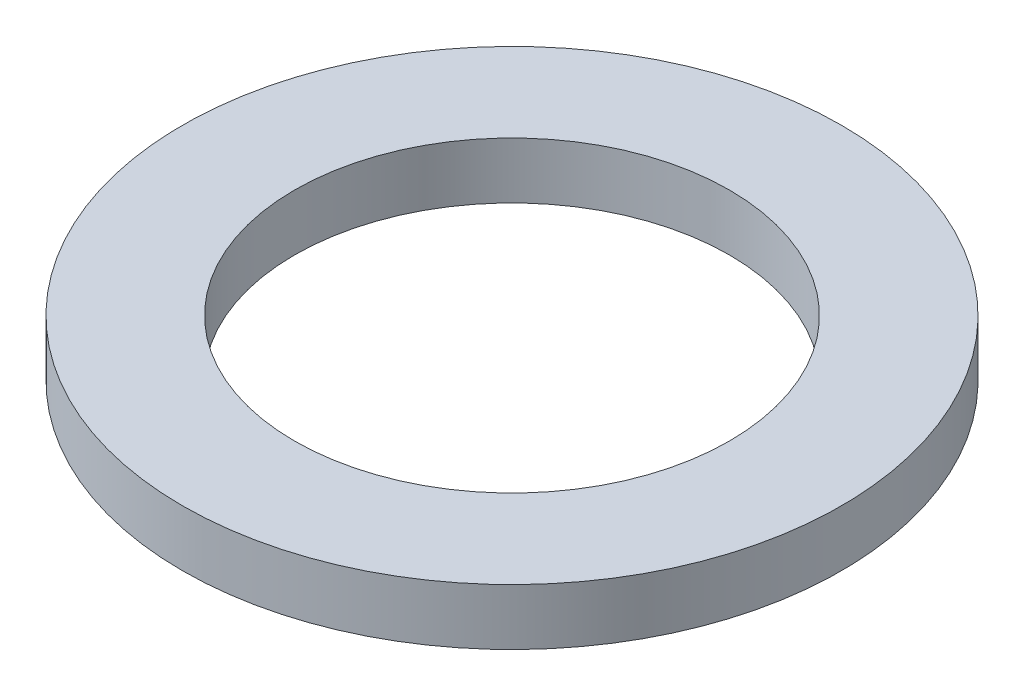
ISO-10303-21;
HEADER;
FILE_DESCRIPTION(('STEP AP214'),'2;1');
FILE_NAME('part.step','',(''),(''),'','','');
FILE_SCHEMA(('AUTOMOTIVE_DESIGN { 1 0 10303 214 1 1 1 1 }'));
ENDSEC;
DATA;
#1=APPLICATION_CONTEXT('core data for automotive mechanical design processes');
#2=APPLICATION_PROTOCOL_DEFINITION('international standard','automotive_design',2000,#1);
#3=PRODUCT_CONTEXT('',#1,'mechanical');
#4=PRODUCT('Part','Part','',(#3));
#5=PRODUCT_RELATED_PRODUCT_CATEGORY('part','',(#4));
#6=PRODUCT_DEFINITION_FORMATION('','',#4);
#7=PRODUCT_DEFINITION_CONTEXT('part definition',#1,'design');
#8=PRODUCT_DEFINITION('design','',#6,#7);
#9=PRODUCT_DEFINITION_SHAPE('','',#8);
#10=(LENGTH_UNIT() NAMED_UNIT(*) SI_UNIT(.MILLI.,.METRE.));
#11=(NAMED_UNIT(*) PLANE_ANGLE_UNIT() SI_UNIT($,.RADIAN.));
#12=(NAMED_UNIT(*) SI_UNIT($,.STERADIAN.) SOLID_ANGLE_UNIT());
#13=UNCERTAINTY_MEASURE_WITH_UNIT(LENGTH_MEASURE(1.E-05),#10,'distance_accuracy_value','');
#14=(GEOMETRIC_REPRESENTATION_CONTEXT(3) GLOBAL_UNCERTAINTY_ASSIGNED_CONTEXT((#13)) GLOBAL_UNIT_ASSIGNED_CONTEXT((#10,
#11,#12)) REPRESENTATION_CONTEXT('',''));
#15=CARTESIAN_POINT('',(0.,0.,0.));
#16=DIRECTION('',(0.,0.,1.));
#17=DIRECTION('',(1.,0.,0.));
#18=AXIS2_PLACEMENT_3D('',#15,#16,#17);
#19=CARTESIAN_POINT('',(0.,0.8382,0.));
#20=DIRECTION('',(0.,1.,0.));
#21=DIRECTION('',(0.,0.,1.));
#22=AXIS2_PLACEMENT_3D('',#19,#20,#21);
#23=PLANE('',#22);
#24=CARTESIAN_POINT('',(0.,0.8382,0.));
#25=DIRECTION('',(0.,1.,0.));
#26=DIRECTION('',(0.,0.,1.));
#27=AXIS2_PLACEMENT_3D('',#24,#25,#26);
#28=CIRCLE('',#27,4.90855);
#29=CARTESIAN_POINT('',(0.,0.8382,4.90855));
#30=VERTEX_POINT('',#29);
#31=EDGE_CURVE('E10',#30,#30,#28,.T.);
#32=ORIENTED_EDGE('',*,*,#31,.T.);
#33=EDGE_LOOP('',(#32));
#34=FACE_BOUND('',#33,.T.);
#35=CARTESIAN_POINT('',(0.,0.8382,0.));
#36=DIRECTION('',(0.,1.,0.));
#37=DIRECTION('',(0.,0.,1.));
#38=AXIS2_PLACEMENT_3D('',#35,#36,#37);
#39=CIRCLE('',#38,3.2385);
#40=CARTESIAN_POINT('',(0.,0.8382,3.2385));
#41=VERTEX_POINT('',#40);
#42=EDGE_CURVE('E41',#41,#41,#39,.T.);
#43=ORIENTED_EDGE('',*,*,#42,.F.);
#44=EDGE_LOOP('',(#43));
#45=FACE_BOUND('',#44,.T.);
#46=ADVANCED_FACE('F30',(#34,#45),#23,.T.);
#47=CARTESIAN_POINT('',(0.,0.,0.));
#48=DIRECTION('',(0.,1.,0.));
#49=DIRECTION('',(0.,0.,1.));
#50=AXIS2_PLACEMENT_3D('',#47,#48,#49);
#51=PLANE('',#50);
#52=CARTESIAN_POINT('',(0.,0.,0.));
#53=DIRECTION('',(0.,1.,0.));
#54=DIRECTION('',(0.,0.,1.));
#55=AXIS2_PLACEMENT_3D('',#52,#53,#54);
#56=CIRCLE('',#55,4.90855);
#57=CARTESIAN_POINT('',(0.,0.,4.90855));
#58=VERTEX_POINT('',#57);
#59=EDGE_CURVE('E34',#58,#58,#56,.T.);
#60=ORIENTED_EDGE('',*,*,#59,.F.);
#61=EDGE_LOOP('',(#60));
#62=FACE_BOUND('',#61,.T.);
#63=CARTESIAN_POINT('',(0.,0.,0.));
#64=DIRECTION('',(0.,1.,0.));
#65=DIRECTION('',(0.,0.,1.));
#66=AXIS2_PLACEMENT_3D('',#63,#64,#65);
#67=CIRCLE('',#66,3.2385);
#68=CARTESIAN_POINT('',(0.,0.,3.2385));
#69=VERTEX_POINT('',#68);
#70=EDGE_CURVE('E43',#69,#69,#67,.T.);
#71=ORIENTED_EDGE('',*,*,#70,.T.);
#72=EDGE_LOOP('',(#71));
#73=FACE_BOUND('',#72,.T.);
#74=ADVANCED_FACE('F53',(#62,#73),#51,.F.);
#75=CARTESIAN_POINT('',(0.,0.8382,0.));
#76=DIRECTION('',(0.,-1.,0.));
#77=DIRECTION('',(0.,0.,-1.));
#78=AXIS2_PLACEMENT_3D('',#75,#76,#77);
#79=CYLINDRICAL_SURFACE('',#78,4.90855);
#80=ORIENTED_EDGE('',*,*,#31,.F.);
#81=EDGE_LOOP('',(#80));
#82=FACE_BOUND('',#81,.T.);
#83=ORIENTED_EDGE('',*,*,#59,.T.);
#84=EDGE_LOOP('',(#83));
#85=FACE_BOUND('',#84,.T.);
#86=ADVANCED_FACE('F32',(#82,#85),#79,.T.);
#87=CARTESIAN_POINT('',(0.,0.8382,0.));
#88=DIRECTION('',(0.,-1.,0.));
#89=DIRECTION('',(0.,0.,-1.));
#90=AXIS2_PLACEMENT_3D('',#87,#88,#89);
#91=CYLINDRICAL_SURFACE('',#90,3.2385);
#92=ORIENTED_EDGE('',*,*,#42,.T.);
#93=EDGE_LOOP('',(#92));
#94=FACE_BOUND('',#93,.T.);
#95=ORIENTED_EDGE('',*,*,#70,.F.);
#96=EDGE_LOOP('',(#95));
#97=FACE_BOUND('',#96,.T.);
#98=ADVANCED_FACE('F49',(#94,#97),#91,.F.);
#99=CLOSED_SHELL('',(#46,#74,#86,#98));
#100=MANIFOLD_SOLID_BREP('B2',#99);
#101=ADVANCED_BREP_SHAPE_REPRESENTATION('',(#18,#100),#14);
#102=SHAPE_DEFINITION_REPRESENTATION(#9,#101);
ENDSEC;
END-ISO-10303-21;
